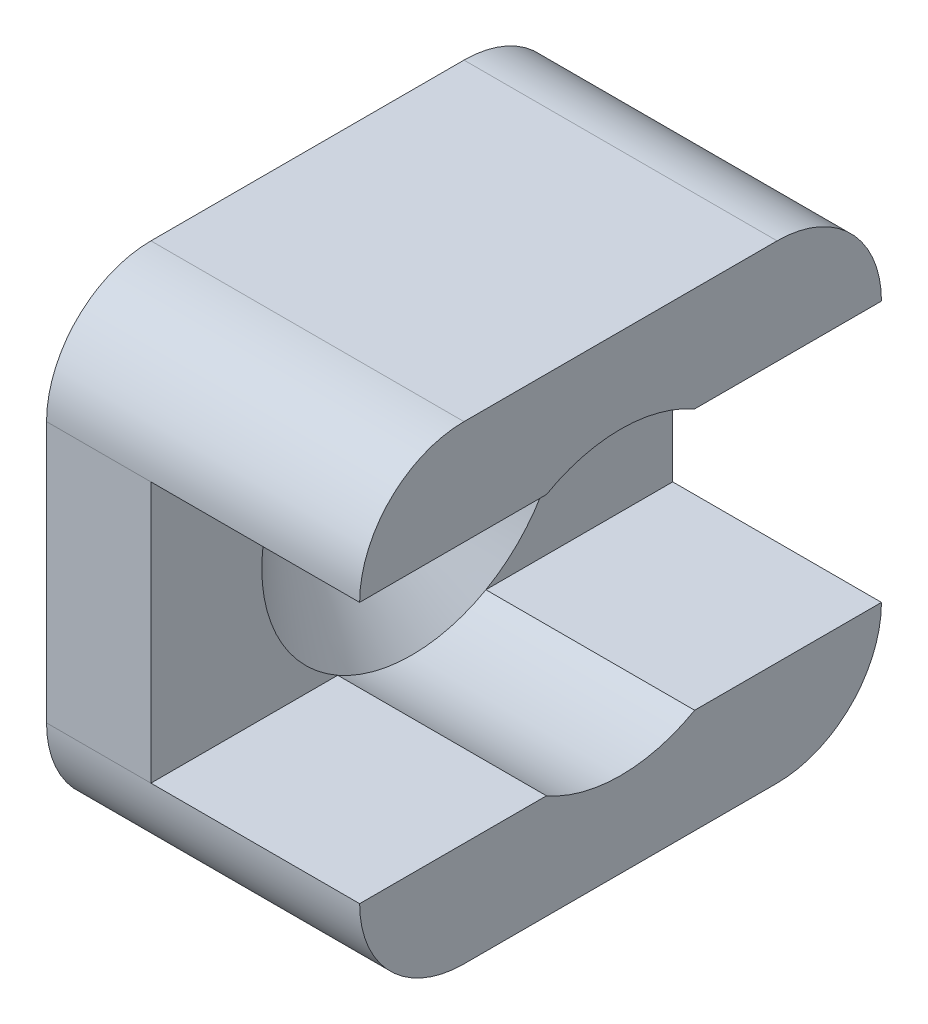
ISO-10303-21;
HEADER;
FILE_DESCRIPTION(('STEP AP214'),'2;1');
FILE_NAME('part.step','',(''),(''),'','','');
FILE_SCHEMA(('AUTOMOTIVE_DESIGN { 1 0 10303 214 1 1 1 1 }'));
ENDSEC;
DATA;
#1=APPLICATION_CONTEXT('core data for automotive mechanical design processes');
#2=APPLICATION_PROTOCOL_DEFINITION('international standard','automotive_design',2000,#1);
#3=PRODUCT_CONTEXT('',#1,'mechanical');
#4=PRODUCT('Part','Part','',(#3));
#5=PRODUCT_RELATED_PRODUCT_CATEGORY('part','',(#4));
#6=PRODUCT_DEFINITION_FORMATION('','',#4);
#7=PRODUCT_DEFINITION_CONTEXT('part definition',#1,'design');
#8=PRODUCT_DEFINITION('design','',#6,#7);
#9=PRODUCT_DEFINITION_SHAPE('','',#8);
#10=(LENGTH_UNIT() NAMED_UNIT(*) SI_UNIT(.MILLI.,.METRE.));
#11=(NAMED_UNIT(*) PLANE_ANGLE_UNIT() SI_UNIT($,.RADIAN.));
#12=(NAMED_UNIT(*) SI_UNIT($,.STERADIAN.) SOLID_ANGLE_UNIT());
#13=UNCERTAINTY_MEASURE_WITH_UNIT(LENGTH_MEASURE(1.E-05),#10,'distance_accuracy_value','');
#14=(GEOMETRIC_REPRESENTATION_CONTEXT(3) GLOBAL_UNCERTAINTY_ASSIGNED_CONTEXT((#13)) GLOBAL_UNIT_ASSIGNED_CONTEXT((#10,
#11,#12)) REPRESENTATION_CONTEXT('',''));
#15=CARTESIAN_POINT('',(0.,0.,0.));
#16=DIRECTION('',(0.,0.,1.));
#17=DIRECTION('',(1.,0.,0.));
#18=AXIS2_PLACEMENT_3D('',#15,#16,#17);
#19=CARTESIAN_POINT('',(0.0788300229999999,5.8,20.));
#20=DIRECTION('',(-1.,0.,0.));
#21=DIRECTION('',(0.,-1.,0.));
#22=AXIS2_PLACEMENT_3D('',#19,#20,#21);
#23=PLANE('',#22);
#24=DIRECTION('',(0.,0.,-1.));
#25=VECTOR('',#24,1.);
#26=CARTESIAN_POINT('',(0.0788300229999999,5.8,20.));
#27=LINE('',#26,#25);
#28=CARTESIAN_POINT('',(0.0788300229999999,5.8,20.));
#29=VERTEX_POINT('',#28);
#30=CARTESIAN_POINT('',(0.0788300230000057,5.79999999955963,12.8394541721247));
#31=VERTEX_POINT('',#30);
#32=EDGE_CURVE('E154',#29,#31,#27,.T.);
#33=ORIENTED_EDGE('',*,*,#32,.T.);
#34=CARTESIAN_POINT('',(0.0788300230000057,10.8,10.));
#35=DIRECTION('',(-1.,0.,0.));
#36=DIRECTION('',(0.,0.,1.));
#37=AXIS2_PLACEMENT_3D('',#34,#35,#36);
#38=CIRCLE('',#37,5.75);
#39=CARTESIAN_POINT('',(0.0788300230000057,15.8000000004404,12.8394541721247));
#40=VERTEX_POINT('',#39);
#41=EDGE_CURVE('E137',#31,#40,#38,.T.);
#42=ORIENTED_EDGE('',*,*,#41,.T.);
#43=DIRECTION('',(0.,0.,-1.));
#44=VECTOR('',#43,1.);
#45=CARTESIAN_POINT('',(0.0788300229999997,15.8,20.));
#46=LINE('',#45,#44);
#47=CARTESIAN_POINT('',(0.0788300229999997,15.8,20.));
#48=VERTEX_POINT('',#47);
#49=EDGE_CURVE('E151',#48,#40,#46,.T.);
#50=ORIENTED_EDGE('',*,*,#49,.F.);
#51=DIRECTION('',(0.,1.,0.));
#52=VECTOR('',#51,1.);
#53=CARTESIAN_POINT('',(0.0788300229999999,5.8,20.));
#54=LINE('',#53,#52);
#55=EDGE_CURVE('E242',#29,#48,#54,.T.);
#56=ORIENTED_EDGE('',*,*,#55,.F.);
#57=EDGE_LOOP('',(#33,#42,#50,#56));
#58=FACE_BOUND('',#57,.T.);
#59=ADVANCED_FACE('F32',(#58),#23,.F.);
#60=CARTESIAN_POINT('',(0.0788300229999997,15.8,20.));
#61=DIRECTION('',(0.,1.,0.));
#62=DIRECTION('',(0.,0.,1.));
#63=AXIS2_PLACEMENT_3D('',#60,#61,#62);
#64=PLANE('',#63);
#65=ORIENTED_EDGE('',*,*,#49,.T.);
#66=DIRECTION('',(1.,0.,0.));
#67=VECTOR('',#66,1.);
#68=CARTESIAN_POINT('',(0.0788300229999997,15.8,12.8394541718746));
#69=LINE('',#68,#67);
#70=CARTESIAN_POINT('',(8.078830023,15.8,12.8394541718746));
#71=VERTEX_POINT('',#70);
#72=EDGE_CURVE('E158',#40,#71,#69,.T.);
#73=ORIENTED_EDGE('',*,*,#72,.T.);
#74=DIRECTION('',(0.,0.,-1.));
#75=VECTOR('',#74,1.);
#76=CARTESIAN_POINT('',(8.078830023,15.8,20.));
#77=LINE('',#76,#75);
#78=CARTESIAN_POINT('',(8.078830023,15.8,20.));
#79=VERTEX_POINT('',#78);
#80=EDGE_CURVE('E173',#79,#71,#77,.T.);
#81=ORIENTED_EDGE('',*,*,#80,.F.);
#82=DIRECTION('',(1.,0.,0.));
#83=VECTOR('',#82,1.);
#84=CARTESIAN_POINT('',(0.0788300229999997,15.8,20.));
#85=LINE('',#84,#83);
#86=EDGE_CURVE('E168',#48,#79,#85,.T.);
#87=ORIENTED_EDGE('',*,*,#86,.F.);
#88=EDGE_LOOP('',(#65,#73,#81,#87));
#89=FACE_BOUND('',#88,.T.);
#90=ADVANCED_FACE('F167',(#89),#64,.F.);
#91=CARTESIAN_POINT('',(8.078830023,5.8,20.));
#92=DIRECTION('',(0.,-1.,0.));
#93=DIRECTION('',(0.,0.,-1.));
#94=AXIS2_PLACEMENT_3D('',#91,#92,#93);
#95=PLANE('',#94);
#96=CARTESIAN_POINT('',(0.0788300230000057,5.80000000044036,7.16054582632443));
#97=VERTEX_POINT('',#96);
#98=CARTESIAN_POINT('',(0.0788300229999999,5.8,0.));
#99=VERTEX_POINT('',#98);
#100=EDGE_CURVE('E179',#97,#99,#27,.T.);
#101=ORIENTED_EDGE('',*,*,#100,.F.);
#102=DIRECTION('',(1.,0.,0.));
#103=VECTOR('',#102,1.);
#104=CARTESIAN_POINT('',(0.0788300229999997,5.8,7.16054582607435));
#105=LINE('',#104,#103);
#106=CARTESIAN_POINT('',(8.078830023,5.8,7.16054582607435));
#107=VERTEX_POINT('',#106);
#108=EDGE_CURVE('E204',#97,#107,#105,.T.);
#109=ORIENTED_EDGE('',*,*,#108,.T.);
#110=DIRECTION('',(0.,0.,-1.));
#111=VECTOR('',#110,1.);
#112=CARTESIAN_POINT('',(8.078830023,5.8,20.));
#113=LINE('',#112,#111);
#114=CARTESIAN_POINT('',(8.078830023,5.8,0.));
#115=VERTEX_POINT('',#114);
#116=EDGE_CURVE('E183',#107,#115,#113,.T.);
#117=ORIENTED_EDGE('',*,*,#116,.T.);
#118=DIRECTION('',(-1.,0.,0.));
#119=VECTOR('',#118,1.);
#120=CARTESIAN_POINT('',(8.078830023,5.8,0.));
#121=LINE('',#120,#119);
#122=EDGE_CURVE('E165',#115,#99,#121,.T.);
#123=ORIENTED_EDGE('',*,*,#122,.T.);
#124=EDGE_LOOP('',(#101,#109,#117,#123));
#125=FACE_BOUND('',#124,.T.);
#126=ADVANCED_FACE('F307',(#125),#95,.F.);
#127=CARTESIAN_POINT('',(8.078830023,0.,0.));
#128=DIRECTION('',(1.,0.,0.));
#129=DIRECTION('',(0.,0.,-1.));
#130=AXIS2_PLACEMENT_3D('',#127,#128,#129);
#131=PLANE('',#130);
#132=CARTESIAN_POINT('',(8.078830023,15.8,7.16054582607435));
#133=VERTEX_POINT('',#132);
#134=CARTESIAN_POINT('',(8.078830023,15.8,0.));
#135=VERTEX_POINT('',#134);
#136=EDGE_CURVE('E170',#133,#135,#77,.T.);
#137=ORIENTED_EDGE('',*,*,#136,.T.);
#138=CARTESIAN_POINT('',(8.078830023,15.8,4.));
#139=DIRECTION('',(1.,0.,0.));
#140=DIRECTION('',(0.,0.,-1.));
#141=AXIS2_PLACEMENT_3D('',#138,#139,#140);
#142=CIRCLE('',#141,4.);
#143=CARTESIAN_POINT('',(8.078830023,19.8,4.));
#144=VERTEX_POINT('',#143);
#145=EDGE_CURVE('E55',#135,#144,#142,.T.);
#146=ORIENTED_EDGE('',*,*,#145,.T.);
#147=DIRECTION('',(0.,0.,1.));
#148=VECTOR('',#147,1.);
#149=CARTESIAN_POINT('',(8.078830023,19.8,0.));
#150=LINE('',#149,#148);
#151=CARTESIAN_POINT('',(8.078830023,19.8,16.));
#152=VERTEX_POINT('',#151);
#153=EDGE_CURVE('E188',#144,#152,#150,.T.);
#154=ORIENTED_EDGE('',*,*,#153,.T.);
#155=CARTESIAN_POINT('',(8.078830023,15.8,16.));
#156=DIRECTION('',(1.,0.,0.));
#157=DIRECTION('',(0.,0.,-1.));
#158=AXIS2_PLACEMENT_3D('',#155,#156,#157);
#159=CIRCLE('',#158,4.);
#160=EDGE_CURVE('E47',#152,#79,#159,.T.);
#161=ORIENTED_EDGE('',*,*,#160,.T.);
#162=ORIENTED_EDGE('',*,*,#80,.T.);
#163=CARTESIAN_POINT('',(8.078830023,10.8,9.99999999897448));
#164=DIRECTION('',(1.,0.,0.));
#165=DIRECTION('',(0.,0.,-1.));
#166=AXIS2_PLACEMENT_3D('',#163,#164,#165);
#167=CIRCLE('',#166,5.75);
#168=EDGE_CURVE('E161',#133,#71,#167,.T.);
#169=ORIENTED_EDGE('',*,*,#168,.F.);
#170=EDGE_LOOP('',(#137,#146,#154,#161,#162,#169));
#171=FACE_BOUND('',#170,.T.);
#172=ADVANCED_FACE('F240',(#171),#131,.T.);
#173=CARTESIAN_POINT('',(-3.921169977,19.8,20.));
#174=DIRECTION('',(0.,0.,1.));
#175=DIRECTION('',(1.,0.,0.));
#176=AXIS2_PLACEMENT_3D('',#173,#174,#175);
#177=PLANE('',#176);
#178=DIRECTION('',(0.,-1.,0.));
#179=VECTOR('',#178,1.);
#180=CARTESIAN_POINT('',(-3.921169977,19.8,20.));
#181=LINE('',#180,#179);
#182=CARTESIAN_POINT('',(-3.921169977,15.8,20.));
#183=VERTEX_POINT('',#182);
#184=CARTESIAN_POINT('',(-3.921169977,5.8,20.));
#185=VERTEX_POINT('',#184);
#186=EDGE_CURVE('E184',#183,#185,#181,.T.);
#187=ORIENTED_EDGE('',*,*,#186,.T.);
#188=DIRECTION('',(1.,0.,0.));
#189=VECTOR('',#188,1.);
#190=CARTESIAN_POINT('',(-3.921169977,5.8,20.));
#191=LINE('',#190,#189);
#192=EDGE_CURVE('E209',#185,#29,#191,.T.);
#193=ORIENTED_EDGE('',*,*,#192,.T.);
#194=ORIENTED_EDGE('',*,*,#55,.T.);
#195=DIRECTION('',(1.,0.,0.));
#196=VECTOR('',#195,1.);
#197=CARTESIAN_POINT('',(-3.921169977,15.8,20.));
#198=LINE('',#197,#196);
#199=EDGE_CURVE('E207',#48,#183,#198,.F.);
#200=ORIENTED_EDGE('',*,*,#199,.T.);
#201=EDGE_LOOP('',(#187,#193,#194,#200));
#202=FACE_BOUND('',#201,.T.);
#203=ADVANCED_FACE('F292',(#202),#177,.T.);
#204=CARTESIAN_POINT('',(-3.921169977,19.8,0.));
#205=DIRECTION('',(0.,1.,0.));
#206=DIRECTION('',(0.,0.,1.));
#207=AXIS2_PLACEMENT_3D('',#204,#205,#206);
#208=PLANE('',#207);
#209=ORIENTED_EDGE('',*,*,#153,.F.);
#210=DIRECTION('',(1.,0.,0.));
#211=VECTOR('',#210,1.);
#212=CARTESIAN_POINT('',(-3.921169977,19.8,4.));
#213=LINE('',#212,#211);
#214=CARTESIAN_POINT('',(-3.921169977,19.8,4.));
#215=VERTEX_POINT('',#214);
#216=EDGE_CURVE('E11',#144,#215,#213,.F.);
#217=ORIENTED_EDGE('',*,*,#216,.T.);
#218=DIRECTION('',(0.,0.,1.));
#219=VECTOR('',#218,1.);
#220=CARTESIAN_POINT('',(-3.921169977,19.8,0.));
#221=LINE('',#220,#219);
#222=CARTESIAN_POINT('',(-3.921169977,19.8,16.));
#223=VERTEX_POINT('',#222);
#224=EDGE_CURVE('E194',#215,#223,#221,.T.);
#225=ORIENTED_EDGE('',*,*,#224,.T.);
#226=DIRECTION('',(1.,0.,0.));
#227=VECTOR('',#226,1.);
#228=CARTESIAN_POINT('',(-3.921169977,19.8,16.));
#229=LINE('',#228,#227);
#230=EDGE_CURVE('E40',#223,#152,#229,.T.);
#231=ORIENTED_EDGE('',*,*,#230,.T.);
#232=EDGE_LOOP('',(#209,#217,#225,#231));
#233=FACE_BOUND('',#232,.T.);
#234=ADVANCED_FACE('F236',(#233),#208,.T.);
#235=CARTESIAN_POINT('',(-3.921169977,1.8,0.));
#236=DIRECTION('',(0.,0.,-1.));
#237=DIRECTION('',(-1.,0.,0.));
#238=AXIS2_PLACEMENT_3D('',#235,#236,#237);
#239=PLANE('',#238);
#240=DIRECTION('',(0.,1.,0.));
#241=VECTOR('',#240,1.);
#242=CARTESIAN_POINT('',(-3.921169977,1.8,0.));
#243=LINE('',#242,#241);
#244=CARTESIAN_POINT('',(-3.921169977,5.8,0.));
#245=VERTEX_POINT('',#244);
#246=CARTESIAN_POINT('',(-3.921169977,15.8,0.));
#247=VERTEX_POINT('',#246);
#248=EDGE_CURVE('E191',#245,#247,#243,.T.);
#249=ORIENTED_EDGE('',*,*,#248,.T.);
#250=DIRECTION('',(1.,0.,0.));
#251=VECTOR('',#250,1.);
#252=CARTESIAN_POINT('',(-3.921169977,15.8,0.));
#253=LINE('',#252,#251);
#254=CARTESIAN_POINT('',(0.0788300229999997,15.8,0.));
#255=VERTEX_POINT('',#254);
#256=EDGE_CURVE('E231',#247,#255,#253,.T.);
#257=ORIENTED_EDGE('',*,*,#256,.T.);
#258=DIRECTION('',(0.,1.,0.));
#259=VECTOR('',#258,1.);
#260=CARTESIAN_POINT('',(0.0788300229999999,5.8,0.));
#261=LINE('',#260,#259);
#262=EDGE_CURVE('E251',#99,#255,#261,.T.);
#263=ORIENTED_EDGE('',*,*,#262,.F.);
#264=DIRECTION('',(1.,0.,0.));
#265=VECTOR('',#264,1.);
#266=CARTESIAN_POINT('',(-3.921169977,5.8,0.));
#267=LINE('',#266,#265);
#268=EDGE_CURVE('E229',#99,#245,#267,.F.);
#269=ORIENTED_EDGE('',*,*,#268,.T.);
#270=EDGE_LOOP('',(#249,#257,#263,#269));
#271=FACE_BOUND('',#270,.T.);
#272=ADVANCED_FACE('F313',(#271),#239,.T.);
#273=CARTESIAN_POINT('',(-3.921169977,1.8,20.));
#274=DIRECTION('',(0.,-1.,0.));
#275=DIRECTION('',(0.,0.,-1.));
#276=AXIS2_PLACEMENT_3D('',#273,#274,#275);
#277=PLANE('',#276);
#278=DIRECTION('',(0.,0.,-1.));
#279=VECTOR('',#278,1.);
#280=CARTESIAN_POINT('',(8.078830023,1.8,20.));
#281=LINE('',#280,#279);
#282=CARTESIAN_POINT('',(8.078830023,1.8,16.));
#283=VERTEX_POINT('',#282);
#284=CARTESIAN_POINT('',(8.078830023,1.8,4.));
#285=VERTEX_POINT('',#284);
#286=EDGE_CURVE('E198',#283,#285,#281,.T.);
#287=ORIENTED_EDGE('',*,*,#286,.F.);
#288=DIRECTION('',(1.,0.,0.));
#289=VECTOR('',#288,1.);
#290=CARTESIAN_POINT('',(-3.921169977,1.8,16.));
#291=LINE('',#290,#289);
#292=CARTESIAN_POINT('',(-3.921169977,1.8,16.));
#293=VERTEX_POINT('',#292);
#294=EDGE_CURVE('E219',#283,#293,#291,.F.);
#295=ORIENTED_EDGE('',*,*,#294,.T.);
#296=DIRECTION('',(0.,0.,-1.));
#297=VECTOR('',#296,1.);
#298=CARTESIAN_POINT('',(-3.921169977,1.8,20.));
#299=LINE('',#298,#297);
#300=CARTESIAN_POINT('',(-3.921169977,1.8,4.));
#301=VERTEX_POINT('',#300);
#302=EDGE_CURVE('E187',#293,#301,#299,.T.);
#303=ORIENTED_EDGE('',*,*,#302,.T.);
#304=DIRECTION('',(1.,0.,0.));
#305=VECTOR('',#304,1.);
#306=CARTESIAN_POINT('',(-3.921169977,1.8,4.));
#307=LINE('',#306,#305);
#308=EDGE_CURVE('E216',#301,#285,#307,.T.);
#309=ORIENTED_EDGE('',*,*,#308,.T.);
#310=EDGE_LOOP('',(#287,#295,#303,#309));
#311=FACE_BOUND('',#310,.T.);
#312=ADVANCED_FACE('F281',(#311),#277,.T.);
#313=CARTESIAN_POINT('',(-3.921169977,0.,0.));
#314=DIRECTION('',(1.,0.,0.));
#315=DIRECTION('',(0.,0.,-1.));
#316=AXIS2_PLACEMENT_3D('',#313,#314,#315);
#317=PLANE('',#316);
#318=CARTESIAN_POINT('',(-3.921169977,10.8,10.));
#319=DIRECTION('',(-1.,0.,0.));
#320=DIRECTION('',(0.,0.,1.));
#321=AXIS2_PLACEMENT_3D('',#318,#319,#320);
#322=CIRCLE('',#321,2.75);
#323=CARTESIAN_POINT('',(-3.921169977,10.8,12.75));
#324=VERTEX_POINT('',#323);
#325=EDGE_CURVE('E155',#324,#324,#322,.T.);
#326=ORIENTED_EDGE('',*,*,#325,.F.);
#327=EDGE_LOOP('',(#326));
#328=FACE_BOUND('',#327,.T.);
#329=ORIENTED_EDGE('',*,*,#302,.F.);
#330=CARTESIAN_POINT('',(-3.921169977,5.8,16.));
#331=DIRECTION('',(1.,0.,0.));
#332=DIRECTION('',(0.,0.,-1.));
#333=AXIS2_PLACEMENT_3D('',#330,#331,#332);
#334=CIRCLE('',#333,4.);
#335=EDGE_CURVE('E227',#293,#185,#334,.F.);
#336=ORIENTED_EDGE('',*,*,#335,.T.);
#337=ORIENTED_EDGE('',*,*,#186,.F.);
#338=CARTESIAN_POINT('',(-3.921169977,15.8,16.));
#339=DIRECTION('',(1.,0.,0.));
#340=DIRECTION('',(0.,0.,-1.));
#341=AXIS2_PLACEMENT_3D('',#338,#339,#340);
#342=CIRCLE('',#341,4.);
#343=EDGE_CURVE('E221',#183,#223,#342,.F.);
#344=ORIENTED_EDGE('',*,*,#343,.T.);
#345=ORIENTED_EDGE('',*,*,#224,.F.);
#346=CARTESIAN_POINT('',(-3.921169977,15.8,4.));
#347=DIRECTION('',(1.,0.,0.));
#348=DIRECTION('',(0.,0.,-1.));
#349=AXIS2_PLACEMENT_3D('',#346,#347,#348);
#350=CIRCLE('',#349,4.);
#351=EDGE_CURVE('E225',#215,#247,#350,.F.);
#352=ORIENTED_EDGE('',*,*,#351,.T.);
#353=ORIENTED_EDGE('',*,*,#248,.F.);
#354=CARTESIAN_POINT('',(-3.921169977,5.8,4.));
#355=DIRECTION('',(1.,0.,0.));
#356=DIRECTION('',(0.,0.,-1.));
#357=AXIS2_PLACEMENT_3D('',#354,#355,#356);
#358=CIRCLE('',#357,4.);
#359=EDGE_CURVE('E223',#245,#301,#358,.F.);
#360=ORIENTED_EDGE('',*,*,#359,.T.);
#361=EDGE_LOOP('',(#329,#336,#337,#344,#345,#352,#353,#360));
#362=FACE_BOUND('',#361,.T.);
#363=ADVANCED_FACE('F277',(#328,#362),#317,.F.);
#364=CARTESIAN_POINT('',(8.078830023,5.8,20.));
#365=VERTEX_POINT('',#364);
#366=CARTESIAN_POINT('',(8.078830023,5.8,12.8394541718746));
#367=VERTEX_POINT('',#366);
#368=EDGE_CURVE('E180',#365,#367,#113,.T.);
#369=ORIENTED_EDGE('',*,*,#368,.F.);
#370=CARTESIAN_POINT('',(8.078830023,5.8,16.));
#371=DIRECTION('',(1.,0.,0.));
#372=DIRECTION('',(0.,0.,-1.));
#373=AXIS2_PLACEMENT_3D('',#370,#371,#372);
#374=CIRCLE('',#373,4.);
#375=EDGE_CURVE('E214',#365,#283,#374,.T.);
#376=ORIENTED_EDGE('',*,*,#375,.T.);
#377=ORIENTED_EDGE('',*,*,#286,.T.);
#378=CARTESIAN_POINT('',(8.078830023,5.8,4.));
#379=DIRECTION('',(1.,0.,0.));
#380=DIRECTION('',(0.,0.,-1.));
#381=AXIS2_PLACEMENT_3D('',#378,#379,#380);
#382=CIRCLE('',#381,4.);
#383=EDGE_CURVE('E212',#285,#115,#382,.T.);
#384=ORIENTED_EDGE('',*,*,#383,.T.);
#385=ORIENTED_EDGE('',*,*,#116,.F.);
#386=EDGE_CURVE('E262',#367,#107,#167,.T.);
#387=ORIENTED_EDGE('',*,*,#386,.F.);
#388=EDGE_LOOP('',(#369,#376,#377,#384,#385,#387));
#389=FACE_BOUND('',#388,.T.);
#390=ADVANCED_FACE('F280',(#389),#131,.T.);
#391=ORIENTED_EDGE('',*,*,#136,.F.);
#392=DIRECTION('',(1.,0.,0.));
#393=VECTOR('',#392,1.);
#394=CARTESIAN_POINT('',(0.0788300229999997,15.8,7.16054582607435));
#395=LINE('',#394,#393);
#396=CARTESIAN_POINT('',(0.0788300229999997,15.8,7.16054582607435));
#397=VERTEX_POINT('',#396);
#398=EDGE_CURVE('E144',#133,#397,#395,.F.);
#399=ORIENTED_EDGE('',*,*,#398,.T.);
#400=EDGE_CURVE('E171',#397,#255,#46,.T.);
#401=ORIENTED_EDGE('',*,*,#400,.T.);
#402=DIRECTION('',(1.,0.,0.));
#403=VECTOR('',#402,1.);
#404=CARTESIAN_POINT('',(0.0788300229999997,15.8,0.));
#405=LINE('',#404,#403);
#406=EDGE_CURVE('E253',#255,#135,#405,.T.);
#407=ORIENTED_EDGE('',*,*,#406,.T.);
#408=EDGE_LOOP('',(#391,#399,#401,#407));
#409=FACE_BOUND('',#408,.T.);
#410=ADVANCED_FACE('F330',(#409),#64,.F.);
#411=ORIENTED_EDGE('',*,*,#400,.F.);
#412=EDGE_CURVE('E140',#397,#97,#38,.T.);
#413=ORIENTED_EDGE('',*,*,#412,.T.);
#414=ORIENTED_EDGE('',*,*,#100,.T.);
#415=ORIENTED_EDGE('',*,*,#262,.T.);
#416=EDGE_LOOP('',(#411,#413,#414,#415));
#417=FACE_BOUND('',#416,.T.);
#418=ADVANCED_FACE('F304',(#417),#23,.F.);
#419=ORIENTED_EDGE('',*,*,#368,.T.);
#420=DIRECTION('',(1.,0.,0.));
#421=VECTOR('',#420,1.);
#422=CARTESIAN_POINT('',(0.0788300229999997,5.8,12.8394541718746));
#423=LINE('',#422,#421);
#424=EDGE_CURVE('E197',#367,#31,#423,.F.);
#425=ORIENTED_EDGE('',*,*,#424,.T.);
#426=ORIENTED_EDGE('',*,*,#32,.F.);
#427=DIRECTION('',(-1.,0.,0.));
#428=VECTOR('',#427,1.);
#429=CARTESIAN_POINT('',(8.078830023,5.8,20.));
#430=LINE('',#429,#428);
#431=EDGE_CURVE('E245',#365,#29,#430,.T.);
#432=ORIENTED_EDGE('',*,*,#431,.F.);
#433=EDGE_LOOP('',(#419,#425,#426,#432));
#434=FACE_BOUND('',#433,.T.);
#435=ADVANCED_FACE('F294',(#434),#95,.F.);
#436=CARTESIAN_POINT('',(0.0788300229999997,10.8,9.99999999897448));
#437=DIRECTION('',(1.,0.,0.));
#438=DIRECTION('',(0.,0.,-1.));
#439=AXIS2_PLACEMENT_3D('',#436,#437,#438);
#440=CYLINDRICAL_SURFACE('',#439,5.75);
#441=CARTESIAN_POINT('',(0.0788300229999997,10.8,9.99999999897448));
#442=DIRECTION('',(1.,0.,0.));
#443=DIRECTION('',(0.,0.,-1.));
#444=AXIS2_PLACEMENT_3D('',#441,#442,#443);
#445=CIRCLE('',#444,5.75);
#446=EDGE_CURVE('E145',#31,#97,#445,.T.);
#447=ORIENTED_EDGE('',*,*,#446,.F.);
#448=ORIENTED_EDGE('',*,*,#424,.F.);
#449=ORIENTED_EDGE('',*,*,#386,.T.);
#450=ORIENTED_EDGE('',*,*,#108,.F.);
#451=EDGE_LOOP('',(#447,#448,#449,#450));
#452=FACE_BOUND('',#451,.T.);
#453=ADVANCED_FACE('F298',(#452),#440,.F.);
#454=EDGE_CURVE('E133',#397,#40,#445,.T.);
#455=ORIENTED_EDGE('',*,*,#454,.F.);
#456=ORIENTED_EDGE('',*,*,#398,.F.);
#457=ORIENTED_EDGE('',*,*,#168,.T.);
#458=ORIENTED_EDGE('',*,*,#72,.F.);
#459=EDGE_LOOP('',(#455,#456,#457,#458));
#460=FACE_BOUND('',#459,.T.);
#461=ADVANCED_FACE('F159',(#460),#440,.F.);
#462=CARTESIAN_POINT('',(-2.921169977,10.8,10.));
#463=DIRECTION('',(1.,0.,0.));
#464=DIRECTION('',(0.,0.,-1.));
#465=AXIS2_PLACEMENT_3D('',#462,#463,#464);
#466=CONICAL_SURFACE('',#465,2.75,0.785398163397448);
#467=ORIENTED_EDGE('',*,*,#454,.T.);
#468=ORIENTED_EDGE('',*,*,#41,.F.);
#469=ORIENTED_EDGE('',*,*,#446,.T.);
#470=ORIENTED_EDGE('',*,*,#412,.F.);
#471=EDGE_LOOP('',(#467,#468,#469,#470));
#472=FACE_BOUND('',#471,.T.);
#473=CARTESIAN_POINT('',(-2.921169977,10.8,10.));
#474=DIRECTION('',(-1.,0.,0.));
#475=DIRECTION('',(0.,0.,1.));
#476=AXIS2_PLACEMENT_3D('',#473,#474,#475);
#477=CIRCLE('',#476,2.75);
#478=CARTESIAN_POINT('',(-2.921169977,10.8,12.75));
#479=VERTEX_POINT('',#478);
#480=EDGE_CURVE('E266',#479,#479,#477,.T.);
#481=ORIENTED_EDGE('',*,*,#480,.T.);
#482=EDGE_LOOP('',(#481));
#483=FACE_BOUND('',#482,.T.);
#484=ADVANCED_FACE('F135',(#472,#483),#466,.F.);
#485=CARTESIAN_POINT('',(0.0788300230000049,10.8,10.));
#486=DIRECTION('',(-1.,0.,0.));
#487=DIRECTION('',(0.,0.,1.));
#488=AXIS2_PLACEMENT_3D('',#485,#486,#487);
#489=CYLINDRICAL_SURFACE('',#488,2.75);
#490=ORIENTED_EDGE('',*,*,#480,.F.);
#491=EDGE_LOOP('',(#490));
#492=FACE_BOUND('',#491,.T.);
#493=ORIENTED_EDGE('',*,*,#325,.T.);
#494=EDGE_LOOP('',(#493));
#495=FACE_BOUND('',#494,.T.);
#496=ADVANCED_FACE('F270',(#492,#495),#489,.F.);
#497=CARTESIAN_POINT('',(-3.921169977,5.8,16.));
#498=DIRECTION('',(1.,0.,0.));
#499=DIRECTION('',(0.,0.,-1.));
#500=AXIS2_PLACEMENT_3D('',#497,#498,#499);
#501=CYLINDRICAL_SURFACE('',#500,4.);
#502=ORIENTED_EDGE('',*,*,#335,.F.);
#503=ORIENTED_EDGE('',*,*,#294,.F.);
#504=ORIENTED_EDGE('',*,*,#375,.F.);
#505=ORIENTED_EDGE('',*,*,#431,.T.);
#506=ORIENTED_EDGE('',*,*,#192,.F.);
#507=EDGE_LOOP('',(#502,#503,#504,#505,#506));
#508=FACE_BOUND('',#507,.T.);
#509=ADVANCED_FACE('F273',(#508),#501,.T.);
#510=CARTESIAN_POINT('',(-3.921169977,15.8,4.));
#511=DIRECTION('',(1.,0.,0.));
#512=DIRECTION('',(0.,0.,-1.));
#513=AXIS2_PLACEMENT_3D('',#510,#511,#512);
#514=CYLINDRICAL_SURFACE('',#513,4.);
#515=ORIENTED_EDGE('',*,*,#351,.F.);
#516=ORIENTED_EDGE('',*,*,#216,.F.);
#517=ORIENTED_EDGE('',*,*,#145,.F.);
#518=ORIENTED_EDGE('',*,*,#406,.F.);
#519=ORIENTED_EDGE('',*,*,#256,.F.);
#520=EDGE_LOOP('',(#515,#516,#517,#518,#519));
#521=FACE_BOUND('',#520,.T.);
#522=ADVANCED_FACE('F360',(#521),#514,.T.);
#523=CARTESIAN_POINT('',(-3.921169977,5.8,4.));
#524=DIRECTION('',(1.,0.,0.));
#525=DIRECTION('',(0.,0.,-1.));
#526=AXIS2_PLACEMENT_3D('',#523,#524,#525);
#527=CYLINDRICAL_SURFACE('',#526,4.);
#528=ORIENTED_EDGE('',*,*,#268,.F.);
#529=ORIENTED_EDGE('',*,*,#122,.F.);
#530=ORIENTED_EDGE('',*,*,#383,.F.);
#531=ORIENTED_EDGE('',*,*,#308,.F.);
#532=ORIENTED_EDGE('',*,*,#359,.F.);
#533=EDGE_LOOP('',(#528,#529,#530,#531,#532));
#534=FACE_BOUND('',#533,.T.);
#535=ADVANCED_FACE('F315',(#534),#527,.T.);
#536=CARTESIAN_POINT('',(-3.921169977,15.8,16.));
#537=DIRECTION('',(1.,0.,0.));
#538=DIRECTION('',(0.,0.,-1.));
#539=AXIS2_PLACEMENT_3D('',#536,#537,#538);
#540=CYLINDRICAL_SURFACE('',#539,4.);
#541=ORIENTED_EDGE('',*,*,#199,.F.);
#542=ORIENTED_EDGE('',*,*,#86,.T.);
#543=ORIENTED_EDGE('',*,*,#160,.F.);
#544=ORIENTED_EDGE('',*,*,#230,.F.);
#545=ORIENTED_EDGE('',*,*,#343,.F.);
#546=EDGE_LOOP('',(#541,#542,#543,#544,#545));
#547=FACE_BOUND('',#546,.T.);
#548=ADVANCED_FACE('F34',(#547),#540,.T.);
#549=CLOSED_SHELL('',(#59,#90,#126,#172,#203,#234,#272,#312,#363,#390,#410,#418,#435,#453,#461,
#484,#496,#509,#522,#535,#548));
#550=MANIFOLD_SOLID_BREP('B2',#549);
#551=ADVANCED_BREP_SHAPE_REPRESENTATION('',(#18,#550),#14);
#552=SHAPE_DEFINITION_REPRESENTATION(#9,#551);
ENDSEC;
END-ISO-10303-21;
